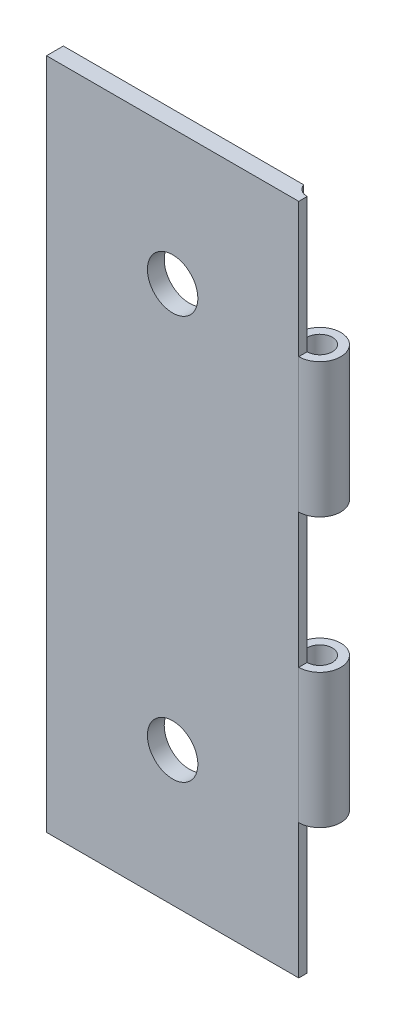
ISO-10303-21;
HEADER;
FILE_DESCRIPTION(('STEP AP214'),'2;1');
FILE_NAME('part.step','',(''),(''),'','','');
FILE_SCHEMA(('AUTOMOTIVE_DESIGN { 1 0 10303 214 1 1 1 1 }'));
ENDSEC;
DATA;
#1=APPLICATION_CONTEXT('core data for automotive mechanical design processes');
#2=APPLICATION_PROTOCOL_DEFINITION('international standard','automotive_design',2000,#1);
#3=PRODUCT_CONTEXT('',#1,'mechanical');
#4=PRODUCT('Part','Part','',(#3));
#5=PRODUCT_RELATED_PRODUCT_CATEGORY('part','',(#4));
#6=PRODUCT_DEFINITION_FORMATION('','',#4);
#7=PRODUCT_DEFINITION_CONTEXT('part definition',#1,'design');
#8=PRODUCT_DEFINITION('design','',#6,#7);
#9=PRODUCT_DEFINITION_SHAPE('','',#8);
#10=(LENGTH_UNIT() NAMED_UNIT(*) SI_UNIT(.MILLI.,.METRE.));
#11=(NAMED_UNIT(*) PLANE_ANGLE_UNIT() SI_UNIT($,.RADIAN.));
#12=(NAMED_UNIT(*) SI_UNIT($,.STERADIAN.) SOLID_ANGLE_UNIT());
#13=UNCERTAINTY_MEASURE_WITH_UNIT(LENGTH_MEASURE(1.E-05),#10,'distance_accuracy_value','');
#14=(GEOMETRIC_REPRESENTATION_CONTEXT(3) GLOBAL_UNCERTAINTY_ASSIGNED_CONTEXT((#13)) GLOBAL_UNIT_ASSIGNED_CONTEXT((#10,
#11,#12)) REPRESENTATION_CONTEXT('',''));
#15=CARTESIAN_POINT('',(0.,0.,0.));
#16=DIRECTION('',(0.,0.,1.));
#17=DIRECTION('',(1.,0.,0.));
#18=AXIS2_PLACEMENT_3D('',#15,#16,#17);
#19=CARTESIAN_POINT('',(7.5,-20.,1.));
#20=DIRECTION('',(-1.,0.,0.));
#21=DIRECTION('',(0.,0.,1.));
#22=AXIS2_PLACEMENT_3D('',#19,#20,#21);
#23=PLANE('',#22);
#24=DIRECTION('',(0.,0.,-1.));
#25=VECTOR('',#24,1.);
#26=CARTESIAN_POINT('',(7.5,-20.,1.));
#27=LINE('',#26,#25);
#28=CARTESIAN_POINT('',(7.5,-20.,1.));
#29=VERTEX_POINT('',#28);
#30=CARTESIAN_POINT('',(7.5,-20.,0.499999999999999));
#31=VERTEX_POINT('',#30);
#32=EDGE_CURVE('E177',#29,#31,#27,.T.);
#33=ORIENTED_EDGE('',*,*,#32,.T.);
#34=DIRECTION('',(0.,1.,0.));
#35=VECTOR('',#34,1.);
#36=CARTESIAN_POINT('',(7.5,-20.,0.499999999999999));
#37=LINE('',#36,#35);
#38=CARTESIAN_POINT('',(7.5,-12.,0.499999999999999));
#39=VERTEX_POINT('',#38);
#40=EDGE_CURVE('E57',#31,#39,#37,.T.);
#41=ORIENTED_EDGE('',*,*,#40,.T.);
#42=DIRECTION('',(0.,0.,-1.));
#43=VECTOR('',#42,1.);
#44=CARTESIAN_POINT('',(7.5,-12.,0.));
#45=LINE('',#44,#43);
#46=CARTESIAN_POINT('',(7.5,-12.,1.));
#47=VERTEX_POINT('',#46);
#48=EDGE_CURVE('E287',#47,#39,#45,.T.);
#49=ORIENTED_EDGE('',*,*,#48,.F.);
#50=DIRECTION('',(0.,1.,0.));
#51=VECTOR('',#50,1.);
#52=CARTESIAN_POINT('',(7.5,-20.,1.));
#53=LINE('',#52,#51);
#54=EDGE_CURVE('E172',#29,#47,#53,.T.);
#55=ORIENTED_EDGE('',*,*,#54,.F.);
#56=EDGE_LOOP('',(#33,#41,#49,#55));
#57=FACE_BOUND('',#56,.T.);
#58=ADVANCED_FACE('F41',(#57),#23,.F.);
#59=DIRECTION('',(0.,0.,-1.));
#60=VECTOR('',#59,1.);
#61=CARTESIAN_POINT('',(7.5,-4.,0.));
#62=LINE('',#61,#60);
#63=CARTESIAN_POINT('',(7.5,-4.,1.));
#64=VERTEX_POINT('',#63);
#65=CARTESIAN_POINT('',(7.5,-4.,0.499999999999999));
#66=VERTEX_POINT('',#65);
#67=EDGE_CURVE('E274',#64,#66,#62,.T.);
#68=ORIENTED_EDGE('',*,*,#67,.T.);
#69=CARTESIAN_POINT('',(7.5,4.,0.499999999999999));
#70=VERTEX_POINT('',#69);
#71=EDGE_CURVE('E144',#66,#70,#37,.T.);
#72=ORIENTED_EDGE('',*,*,#71,.T.);
#73=DIRECTION('',(0.,0.,-1.));
#74=VECTOR('',#73,1.);
#75=CARTESIAN_POINT('',(7.5,4.,0.));
#76=LINE('',#75,#74);
#77=CARTESIAN_POINT('',(7.5,4.,1.));
#78=VERTEX_POINT('',#77);
#79=EDGE_CURVE('E253',#78,#70,#76,.T.);
#80=ORIENTED_EDGE('',*,*,#79,.F.);
#81=EDGE_CURVE('E170',#64,#78,#53,.T.);
#82=ORIENTED_EDGE('',*,*,#81,.F.);
#83=EDGE_LOOP('',(#68,#72,#80,#82));
#84=FACE_BOUND('',#83,.T.);
#85=ADVANCED_FACE('F321',(#84),#23,.F.);
#86=CARTESIAN_POINT('',(0.,0.,0.));
#87=DIRECTION('',(0.,0.,-1.));
#88=DIRECTION('',(-1.,0.,0.));
#89=AXIS2_PLACEMENT_3D('',#86,#87,#88);
#90=PLANE('',#89);
#91=DIRECTION('',(0.,1.,0.));
#92=VECTOR('',#91,1.);
#93=CARTESIAN_POINT('',(6.79289321881345,-20.,0.));
#94=LINE('',#93,#92);
#95=CARTESIAN_POINT('',(6.79289321881345,-20.,0.));
#96=VERTEX_POINT('',#95);
#97=CARTESIAN_POINT('',(6.79289321881345,-12.,0.));
#98=VERTEX_POINT('',#97);
#99=EDGE_CURVE('E138',#96,#98,#94,.T.);
#100=ORIENTED_EDGE('',*,*,#99,.F.);
#101=DIRECTION('',(1.,0.,0.));
#102=VECTOR('',#101,1.);
#103=CARTESIAN_POINT('',(-7.5,-20.,0.));
#104=LINE('',#103,#102);
#105=CARTESIAN_POINT('',(-7.5,-20.,0.));
#106=VERTEX_POINT('',#105);
#107=EDGE_CURVE('E151',#106,#96,#104,.T.);
#108=ORIENTED_EDGE('',*,*,#107,.F.);
#109=DIRECTION('',(0.,-1.,0.));
#110=VECTOR('',#109,1.);
#111=CARTESIAN_POINT('',(-7.5,-20.,0.));
#112=LINE('',#111,#110);
#113=CARTESIAN_POINT('',(-7.5,20.,0.));
#114=VERTEX_POINT('',#113);
#115=EDGE_CURVE('E166',#114,#106,#112,.T.);
#116=ORIENTED_EDGE('',*,*,#115,.F.);
#117=DIRECTION('',(-1.,0.,0.));
#118=VECTOR('',#117,1.);
#119=CARTESIAN_POINT('',(-7.5,20.,0.));
#120=LINE('',#119,#118);
#121=CARTESIAN_POINT('',(6.79289321881345,20.,0.));
#122=VERTEX_POINT('',#121);
#123=EDGE_CURVE('E173',#122,#114,#120,.T.);
#124=ORIENTED_EDGE('',*,*,#123,.F.);
#125=CARTESIAN_POINT('',(6.79289321881345,12.,0.));
#126=VERTEX_POINT('',#125);
#127=EDGE_CURVE('E157',#126,#122,#94,.T.);
#128=ORIENTED_EDGE('',*,*,#127,.F.);
#129=DIRECTION('',(-1.,0.,0.));
#130=VECTOR('',#129,1.);
#131=CARTESIAN_POINT('',(0.,12.,0.));
#132=LINE('',#131,#130);
#133=CARTESIAN_POINT('',(6.27525512860841,12.,0.));
#134=VERTEX_POINT('',#133);
#135=EDGE_CURVE('E230',#126,#134,#132,.T.);
#136=ORIENTED_EDGE('',*,*,#135,.T.);
#137=DIRECTION('',(0.,1.,0.));
#138=VECTOR('',#137,1.);
#139=CARTESIAN_POINT('',(6.27525512860841,4.,0.));
#140=LINE('',#139,#138);
#141=CARTESIAN_POINT('',(6.27525512860841,4.,0.));
#142=VERTEX_POINT('',#141);
#143=EDGE_CURVE('E218',#142,#134,#140,.T.);
#144=ORIENTED_EDGE('',*,*,#143,.F.);
#145=DIRECTION('',(-1.,0.,0.));
#146=VECTOR('',#145,1.);
#147=CARTESIAN_POINT('',(0.,4.,0.));
#148=LINE('',#147,#146);
#149=CARTESIAN_POINT('',(6.79289321881345,4.,0.));
#150=VERTEX_POINT('',#149);
#151=EDGE_CURVE('E226',#150,#142,#148,.T.);
#152=ORIENTED_EDGE('',*,*,#151,.F.);
#153=CARTESIAN_POINT('',(6.79289321881345,-4.,0.));
#154=VERTEX_POINT('',#153);
#155=EDGE_CURVE('E158',#154,#150,#94,.T.);
#156=ORIENTED_EDGE('',*,*,#155,.F.);
#157=DIRECTION('',(-1.,0.,0.));
#158=VECTOR('',#157,1.);
#159=CARTESIAN_POINT('',(0.,-4.,0.));
#160=LINE('',#159,#158);
#161=CARTESIAN_POINT('',(6.27525512860841,-4.,0.));
#162=VERTEX_POINT('',#161);
#163=EDGE_CURVE('E266',#154,#162,#160,.T.);
#164=ORIENTED_EDGE('',*,*,#163,.T.);
#165=DIRECTION('',(0.,1.,0.));
#166=VECTOR('',#165,1.);
#167=CARTESIAN_POINT('',(6.27525512860841,-12.,0.));
#168=LINE('',#167,#166);
#169=CARTESIAN_POINT('',(6.27525512860841,-12.,0.));
#170=VERTEX_POINT('',#169);
#171=EDGE_CURVE('E65',#170,#162,#168,.T.);
#172=ORIENTED_EDGE('',*,*,#171,.F.);
#173=DIRECTION('',(-1.,0.,0.));
#174=VECTOR('',#173,1.);
#175=CARTESIAN_POINT('',(0.,-12.,0.));
#176=LINE('',#175,#174);
#177=EDGE_CURVE('E152',#98,#170,#176,.T.);
#178=ORIENTED_EDGE('',*,*,#177,.F.);
#179=EDGE_LOOP('',(#100,#108,#116,#124,#128,#136,#144,#152,#156,#164,#172,#178));
#180=FACE_BOUND('',#179,.T.);
#181=CARTESIAN_POINT('',(0.,12.,0.));
#182=DIRECTION('',(0.,0.,1.));
#183=DIRECTION('',(1.,0.,0.));
#184=AXIS2_PLACEMENT_3D('',#181,#182,#183);
#185=CIRCLE('',#184,1.5);
#186=CARTESIAN_POINT('',(1.5,12.,0.));
#187=VERTEX_POINT('',#186);
#188=EDGE_CURVE('E198',#187,#187,#185,.T.);
#189=ORIENTED_EDGE('',*,*,#188,.T.);
#190=EDGE_LOOP('',(#189));
#191=FACE_BOUND('',#190,.T.);
#192=CARTESIAN_POINT('',(0.,-12.,0.));
#193=DIRECTION('',(0.,0.,1.));
#194=DIRECTION('',(-1.,0.,0.));
#195=AXIS2_PLACEMENT_3D('',#192,#193,#194);
#196=CIRCLE('',#195,1.5);
#197=CARTESIAN_POINT('',(-1.5,-12.,0.));
#198=VERTEX_POINT('',#197);
#199=EDGE_CURVE('E214',#198,#198,#196,.T.);
#200=ORIENTED_EDGE('',*,*,#199,.T.);
#201=EDGE_LOOP('',(#200));
#202=FACE_BOUND('',#201,.T.);
#203=ADVANCED_FACE('F148',(#180,#191,#202),#90,.T.);
#204=DIRECTION('',(0.,0.,-1.));
#205=VECTOR('',#204,1.);
#206=CARTESIAN_POINT('',(7.5,12.,0.));
#207=LINE('',#206,#205);
#208=CARTESIAN_POINT('',(7.5,12.,1.));
#209=VERTEX_POINT('',#208);
#210=CARTESIAN_POINT('',(7.5,12.,0.499999999999999));
#211=VERTEX_POINT('',#210);
#212=EDGE_CURVE('E238',#209,#211,#207,.T.);
#213=ORIENTED_EDGE('',*,*,#212,.T.);
#214=CARTESIAN_POINT('',(7.5,20.,0.499999999999999));
#215=VERTEX_POINT('',#214);
#216=EDGE_CURVE('E294',#211,#215,#37,.T.);
#217=ORIENTED_EDGE('',*,*,#216,.T.);
#218=DIRECTION('',(0.,0.,-1.));
#219=VECTOR('',#218,1.);
#220=CARTESIAN_POINT('',(7.5,20.,1.));
#221=LINE('',#220,#219);
#222=CARTESIAN_POINT('',(7.5,20.,1.));
#223=VERTEX_POINT('',#222);
#224=EDGE_CURVE('E11',#223,#215,#221,.T.);
#225=ORIENTED_EDGE('',*,*,#224,.F.);
#226=EDGE_CURVE('E165',#209,#223,#53,.T.);
#227=ORIENTED_EDGE('',*,*,#226,.F.);
#228=EDGE_LOOP('',(#213,#217,#225,#227));
#229=FACE_BOUND('',#228,.T.);
#230=ADVANCED_FACE('F43',(#229),#23,.F.);
#231=CARTESIAN_POINT('',(0.,0.,1.));
#232=DIRECTION('',(0.,0.,-1.));
#233=DIRECTION('',(-1.,0.,0.));
#234=AXIS2_PLACEMENT_3D('',#231,#232,#233);
#235=PLANE('',#234);
#236=ORIENTED_EDGE('',*,*,#54,.T.);
#237=DIRECTION('',(0.,1.,0.));
#238=VECTOR('',#237,1.);
#239=CARTESIAN_POINT('',(7.5,-12.,1.));
#240=LINE('',#239,#238);
#241=EDGE_CURVE('E260',#47,#64,#240,.T.);
#242=ORIENTED_EDGE('',*,*,#241,.T.);
#243=ORIENTED_EDGE('',*,*,#81,.T.);
#244=DIRECTION('',(0.,1.,0.));
#245=VECTOR('',#244,1.);
#246=CARTESIAN_POINT('',(7.5,4.,1.));
#247=LINE('',#246,#245);
#248=EDGE_CURVE('E222',#78,#209,#247,.T.);
#249=ORIENTED_EDGE('',*,*,#248,.T.);
#250=ORIENTED_EDGE('',*,*,#226,.T.);
#251=DIRECTION('',(-1.,0.,0.));
#252=VECTOR('',#251,1.);
#253=CARTESIAN_POINT('',(-7.5,20.,1.));
#254=LINE('',#253,#252);
#255=CARTESIAN_POINT('',(-7.5,20.,1.));
#256=VERTEX_POINT('',#255);
#257=EDGE_CURVE('E205',#223,#256,#254,.T.);
#258=ORIENTED_EDGE('',*,*,#257,.T.);
#259=DIRECTION('',(0.,-1.,0.));
#260=VECTOR('',#259,1.);
#261=CARTESIAN_POINT('',(-7.5,-20.,1.));
#262=LINE('',#261,#260);
#263=CARTESIAN_POINT('',(-7.5,-20.,1.));
#264=VERTEX_POINT('',#263);
#265=EDGE_CURVE('E188',#256,#264,#262,.T.);
#266=ORIENTED_EDGE('',*,*,#265,.T.);
#267=DIRECTION('',(1.,0.,0.));
#268=VECTOR('',#267,1.);
#269=CARTESIAN_POINT('',(-7.5,-20.,1.));
#270=LINE('',#269,#268);
#271=EDGE_CURVE('E180',#264,#29,#270,.T.);
#272=ORIENTED_EDGE('',*,*,#271,.T.);
#273=EDGE_LOOP('',(#236,#242,#243,#249,#250,#258,#266,#272));
#274=FACE_BOUND('',#273,.T.);
#275=CARTESIAN_POINT('',(0.,12.,1.));
#276=DIRECTION('',(0.,0.,1.));
#277=DIRECTION('',(1.,0.,0.));
#278=AXIS2_PLACEMENT_3D('',#275,#276,#277);
#279=CIRCLE('',#278,1.5);
#280=CARTESIAN_POINT('',(1.5,12.,1.));
#281=VERTEX_POINT('',#280);
#282=EDGE_CURVE('E195',#281,#281,#279,.T.);
#283=ORIENTED_EDGE('',*,*,#282,.F.);
#284=EDGE_LOOP('',(#283));
#285=FACE_BOUND('',#284,.T.);
#286=CARTESIAN_POINT('',(0.,-12.,1.));
#287=DIRECTION('',(0.,0.,1.));
#288=DIRECTION('',(-1.,0.,0.));
#289=AXIS2_PLACEMENT_3D('',#286,#287,#288);
#290=CIRCLE('',#289,1.5);
#291=CARTESIAN_POINT('',(-1.5,-12.,1.));
#292=VERTEX_POINT('',#291);
#293=EDGE_CURVE('E212',#292,#292,#290,.T.);
#294=ORIENTED_EDGE('',*,*,#293,.F.);
#295=EDGE_LOOP('',(#294));
#296=FACE_BOUND('',#295,.T.);
#297=ADVANCED_FACE('F307',(#274,#285,#296),#235,.F.);
#298=CARTESIAN_POINT('',(-7.5,20.,1.));
#299=DIRECTION('',(0.,-1.,0.));
#300=DIRECTION('',(0.,0.,-1.));
#301=AXIS2_PLACEMENT_3D('',#298,#299,#300);
#302=PLANE('',#301);
#303=ORIENTED_EDGE('',*,*,#224,.T.);
#304=CARTESIAN_POINT('',(7.5,20.,-0.25));
#305=DIRECTION('',(0.,1.,0.));
#306=DIRECTION('',(0.,0.,1.));
#307=AXIS2_PLACEMENT_3D('',#304,#305,#306);
#308=CIRCLE('',#307,0.749999999999999);
#309=EDGE_CURVE('E145',#122,#215,#308,.T.);
#310=ORIENTED_EDGE('',*,*,#309,.F.);
#311=ORIENTED_EDGE('',*,*,#123,.T.);
#312=DIRECTION('',(0.,0.,-1.));
#313=VECTOR('',#312,1.);
#314=CARTESIAN_POINT('',(-7.5,20.,1.));
#315=LINE('',#314,#313);
#316=EDGE_CURVE('E50',#256,#114,#315,.T.);
#317=ORIENTED_EDGE('',*,*,#316,.F.);
#318=ORIENTED_EDGE('',*,*,#257,.F.);
#319=EDGE_LOOP('',(#303,#310,#311,#317,#318));
#320=FACE_BOUND('',#319,.T.);
#321=ADVANCED_FACE('F305',(#320),#302,.F.);
#322=CARTESIAN_POINT('',(-7.5,-20.,1.));
#323=DIRECTION('',(1.,0.,0.));
#324=DIRECTION('',(0.,0.,-1.));
#325=AXIS2_PLACEMENT_3D('',#322,#323,#324);
#326=PLANE('',#325);
#327=ORIENTED_EDGE('',*,*,#115,.T.);
#328=DIRECTION('',(0.,0.,-1.));
#329=VECTOR('',#328,1.);
#330=CARTESIAN_POINT('',(-7.5,-20.,1.));
#331=LINE('',#330,#329);
#332=EDGE_CURVE('E163',#264,#106,#331,.T.);
#333=ORIENTED_EDGE('',*,*,#332,.F.);
#334=ORIENTED_EDGE('',*,*,#265,.F.);
#335=ORIENTED_EDGE('',*,*,#316,.T.);
#336=EDGE_LOOP('',(#327,#333,#334,#335));
#337=FACE_BOUND('',#336,.T.);
#338=ADVANCED_FACE('F187',(#337),#326,.F.);
#339=CARTESIAN_POINT('',(-7.5,-20.,1.));
#340=DIRECTION('',(0.,1.,0.));
#341=DIRECTION('',(0.,0.,1.));
#342=AXIS2_PLACEMENT_3D('',#339,#340,#341);
#343=PLANE('',#342);
#344=ORIENTED_EDGE('',*,*,#107,.T.);
#345=CARTESIAN_POINT('',(7.5,-20.,-0.25));
#346=DIRECTION('',(0.,1.,0.));
#347=DIRECTION('',(0.,0.,1.));
#348=AXIS2_PLACEMENT_3D('',#345,#346,#347);
#349=CIRCLE('',#348,0.749999999999999);
#350=EDGE_CURVE('E135',#96,#31,#349,.T.);
#351=ORIENTED_EDGE('',*,*,#350,.T.);
#352=ORIENTED_EDGE('',*,*,#32,.F.);
#353=ORIENTED_EDGE('',*,*,#271,.F.);
#354=ORIENTED_EDGE('',*,*,#332,.T.);
#355=EDGE_LOOP('',(#344,#351,#352,#353,#354));
#356=FACE_BOUND('',#355,.T.);
#357=ADVANCED_FACE('F160',(#356),#343,.F.);
#358=CARTESIAN_POINT('',(0.,12.,1.));
#359=DIRECTION('',(0.,0.,-1.));
#360=DIRECTION('',(-1.,0.,0.));
#361=AXIS2_PLACEMENT_3D('',#358,#359,#360);
#362=CYLINDRICAL_SURFACE('',#361,1.5);
#363=ORIENTED_EDGE('',*,*,#282,.T.);
#364=EDGE_LOOP('',(#363));
#365=FACE_BOUND('',#364,.T.);
#366=ORIENTED_EDGE('',*,*,#188,.F.);
#367=EDGE_LOOP('',(#366));
#368=FACE_BOUND('',#367,.T.);
#369=ADVANCED_FACE('F355',(#365,#368),#362,.F.);
#370=CARTESIAN_POINT('',(0.,-12.,1.));
#371=DIRECTION('',(0.,0.,-1.));
#372=DIRECTION('',(-1.,0.,0.));
#373=AXIS2_PLACEMENT_3D('',#370,#371,#372);
#374=CYLINDRICAL_SURFACE('',#373,1.5);
#375=ORIENTED_EDGE('',*,*,#293,.T.);
#376=EDGE_LOOP('',(#375));
#377=FACE_BOUND('',#376,.T.);
#378=ORIENTED_EDGE('',*,*,#199,.F.);
#379=EDGE_LOOP('',(#378));
#380=FACE_BOUND('',#379,.T.);
#381=ADVANCED_FACE('F377',(#377,#380),#374,.F.);
#382=CARTESIAN_POINT('',(7.5,4.,-0.25));
#383=DIRECTION('',(0.,1.,0.));
#384=DIRECTION('',(0.,0.,1.));
#385=AXIS2_PLACEMENT_3D('',#382,#383,#384);
#386=CYLINDRICAL_SURFACE('',#385,0.749999999999999);
#387=CARTESIAN_POINT('',(7.5,-4.,-0.25));
#388=DIRECTION('',(0.,1.,0.));
#389=DIRECTION('',(0.,0.,1.));
#390=AXIS2_PLACEMENT_3D('',#387,#388,#389);
#391=CIRCLE('',#390,0.749999999999999);
#392=EDGE_CURVE('E155',#66,#154,#391,.T.);
#393=ORIENTED_EDGE('',*,*,#392,.T.);
#394=ORIENTED_EDGE('',*,*,#155,.T.);
#395=CARTESIAN_POINT('',(7.5,4.,-0.25));
#396=DIRECTION('',(0.,1.,0.));
#397=DIRECTION('',(0.,0.,1.));
#398=AXIS2_PLACEMENT_3D('',#395,#396,#397);
#399=CIRCLE('',#398,0.749999999999999);
#400=EDGE_CURVE('E233',#70,#150,#399,.T.);
#401=ORIENTED_EDGE('',*,*,#400,.F.);
#402=ORIENTED_EDGE('',*,*,#71,.F.);
#403=EDGE_LOOP('',(#393,#394,#401,#402));
#404=FACE_BOUND('',#403,.T.);
#405=CARTESIAN_POINT('',(7.5,12.,-0.25));
#406=DIRECTION('',(0.,1.,0.));
#407=DIRECTION('',(0.,0.,1.));
#408=AXIS2_PLACEMENT_3D('',#405,#406,#407);
#409=CIRCLE('',#408,0.749999999999999);
#410=EDGE_CURVE('E242',#211,#126,#409,.T.);
#411=ORIENTED_EDGE('',*,*,#410,.T.);
#412=ORIENTED_EDGE('',*,*,#127,.T.);
#413=ORIENTED_EDGE('',*,*,#309,.T.);
#414=ORIENTED_EDGE('',*,*,#216,.F.);
#415=EDGE_LOOP('',(#411,#412,#413,#414));
#416=FACE_BOUND('',#415,.T.);
#417=ORIENTED_EDGE('',*,*,#99,.T.);
#418=CARTESIAN_POINT('',(7.5,-12.,-0.25));
#419=DIRECTION('',(0.,1.,0.));
#420=DIRECTION('',(0.,0.,1.));
#421=AXIS2_PLACEMENT_3D('',#418,#419,#420);
#422=CIRCLE('',#421,0.749999999999999);
#423=EDGE_CURVE('E269',#39,#98,#422,.T.);
#424=ORIENTED_EDGE('',*,*,#423,.F.);
#425=ORIENTED_EDGE('',*,*,#40,.F.);
#426=ORIENTED_EDGE('',*,*,#350,.F.);
#427=EDGE_LOOP('',(#417,#424,#425,#426));
#428=FACE_BOUND('',#427,.T.);
#429=ADVANCED_FACE('F137',(#404,#416,#428),#386,.F.);
#430=CARTESIAN_POINT('',(7.5,4.,-0.25));
#431=DIRECTION('',(0.,1.,0.));
#432=DIRECTION('',(0.,0.,1.));
#433=AXIS2_PLACEMENT_3D('',#430,#431,#432);
#434=CYLINDRICAL_SURFACE('',#433,1.25);
#435=CARTESIAN_POINT('',(7.5,12.,-0.25));
#436=DIRECTION('',(0.,1.,0.));
#437=DIRECTION('',(0.,0.,1.));
#438=AXIS2_PLACEMENT_3D('',#435,#436,#437);
#439=CIRCLE('',#438,1.25);
#440=EDGE_CURVE('E234',#209,#134,#439,.T.);
#441=ORIENTED_EDGE('',*,*,#440,.F.);
#442=ORIENTED_EDGE('',*,*,#248,.F.);
#443=CARTESIAN_POINT('',(7.5,4.,-0.25));
#444=DIRECTION('',(0.,1.,0.));
#445=DIRECTION('',(0.,0.,1.));
#446=AXIS2_PLACEMENT_3D('',#443,#444,#445);
#447=CIRCLE('',#446,1.25);
#448=EDGE_CURVE('E249',#78,#142,#447,.T.);
#449=ORIENTED_EDGE('',*,*,#448,.T.);
#450=ORIENTED_EDGE('',*,*,#143,.T.);
#451=EDGE_LOOP('',(#441,#442,#449,#450));
#452=FACE_BOUND('',#451,.T.);
#453=ADVANCED_FACE('F314',(#452),#434,.T.);
#454=CARTESIAN_POINT('',(0.,4.,0.));
#455=DIRECTION('',(0.,1.,0.));
#456=DIRECTION('',(0.,0.,1.));
#457=AXIS2_PLACEMENT_3D('',#454,#455,#456);
#458=PLANE('',#457);
#459=ORIENTED_EDGE('',*,*,#400,.T.);
#460=ORIENTED_EDGE('',*,*,#151,.T.);
#461=ORIENTED_EDGE('',*,*,#448,.F.);
#462=ORIENTED_EDGE('',*,*,#79,.T.);
#463=EDGE_LOOP('',(#459,#460,#461,#462));
#464=FACE_BOUND('',#463,.T.);
#465=ADVANCED_FACE('F317',(#464),#458,.F.);
#466=CARTESIAN_POINT('',(0.,12.,0.));
#467=DIRECTION('',(0.,1.,0.));
#468=DIRECTION('',(0.,0.,1.));
#469=AXIS2_PLACEMENT_3D('',#466,#467,#468);
#470=PLANE('',#469);
#471=ORIENTED_EDGE('',*,*,#410,.F.);
#472=ORIENTED_EDGE('',*,*,#212,.F.);
#473=ORIENTED_EDGE('',*,*,#440,.T.);
#474=ORIENTED_EDGE('',*,*,#135,.F.);
#475=EDGE_LOOP('',(#471,#472,#473,#474));
#476=FACE_BOUND('',#475,.T.);
#477=ADVANCED_FACE('F402',(#476),#470,.T.);
#478=CARTESIAN_POINT('',(7.5,-12.,-0.25));
#479=DIRECTION('',(0.,1.,0.));
#480=DIRECTION('',(0.,0.,1.));
#481=AXIS2_PLACEMENT_3D('',#478,#479,#480);
#482=CYLINDRICAL_SURFACE('',#481,1.25);
#483=CARTESIAN_POINT('',(7.5,-4.,-0.25));
#484=DIRECTION('',(0.,1.,0.));
#485=DIRECTION('',(0.,0.,1.));
#486=AXIS2_PLACEMENT_3D('',#483,#484,#485);
#487=CIRCLE('',#486,1.25);
#488=EDGE_CURVE('E270',#64,#162,#487,.T.);
#489=ORIENTED_EDGE('',*,*,#488,.F.);
#490=ORIENTED_EDGE('',*,*,#241,.F.);
#491=CARTESIAN_POINT('',(7.5,-12.,-0.25));
#492=DIRECTION('',(0.,1.,0.));
#493=DIRECTION('',(0.,0.,1.));
#494=AXIS2_PLACEMENT_3D('',#491,#492,#493);
#495=CIRCLE('',#494,1.25);
#496=EDGE_CURVE('E283',#47,#170,#495,.T.);
#497=ORIENTED_EDGE('',*,*,#496,.T.);
#498=ORIENTED_EDGE('',*,*,#171,.T.);
#499=EDGE_LOOP('',(#489,#490,#497,#498));
#500=FACE_BOUND('',#499,.T.);
#501=ADVANCED_FACE('F329',(#500),#482,.T.);
#502=CARTESIAN_POINT('',(0.,-12.,0.));
#503=DIRECTION('',(0.,1.,0.));
#504=DIRECTION('',(0.,0.,1.));
#505=AXIS2_PLACEMENT_3D('',#502,#503,#504);
#506=PLANE('',#505);
#507=ORIENTED_EDGE('',*,*,#423,.T.);
#508=ORIENTED_EDGE('',*,*,#177,.T.);
#509=ORIENTED_EDGE('',*,*,#496,.F.);
#510=ORIENTED_EDGE('',*,*,#48,.T.);
#511=EDGE_LOOP('',(#507,#508,#509,#510));
#512=FACE_BOUND('',#511,.T.);
#513=ADVANCED_FACE('F333',(#512),#506,.F.);
#514=CARTESIAN_POINT('',(0.,-4.,0.));
#515=DIRECTION('',(0.,1.,0.));
#516=DIRECTION('',(0.,0.,1.));
#517=AXIS2_PLACEMENT_3D('',#514,#515,#516);
#518=PLANE('',#517);
#519=ORIENTED_EDGE('',*,*,#392,.F.);
#520=ORIENTED_EDGE('',*,*,#67,.F.);
#521=ORIENTED_EDGE('',*,*,#488,.T.);
#522=ORIENTED_EDGE('',*,*,#163,.F.);
#523=EDGE_LOOP('',(#519,#520,#521,#522));
#524=FACE_BOUND('',#523,.T.);
#525=ADVANCED_FACE('F327',(#524),#518,.T.);
#526=CLOSED_SHELL('',(#58,#85,#203,#230,#297,#321,#338,#357,#369,#381,#429,#453,#465,#477,#501,
#513,#525));
#527=MANIFOLD_SOLID_BREP('B2',#526);
#528=ADVANCED_BREP_SHAPE_REPRESENTATION('',(#18,#527),#14);
#529=SHAPE_DEFINITION_REPRESENTATION(#9,#528);
ENDSEC;
END-ISO-10303-21;
